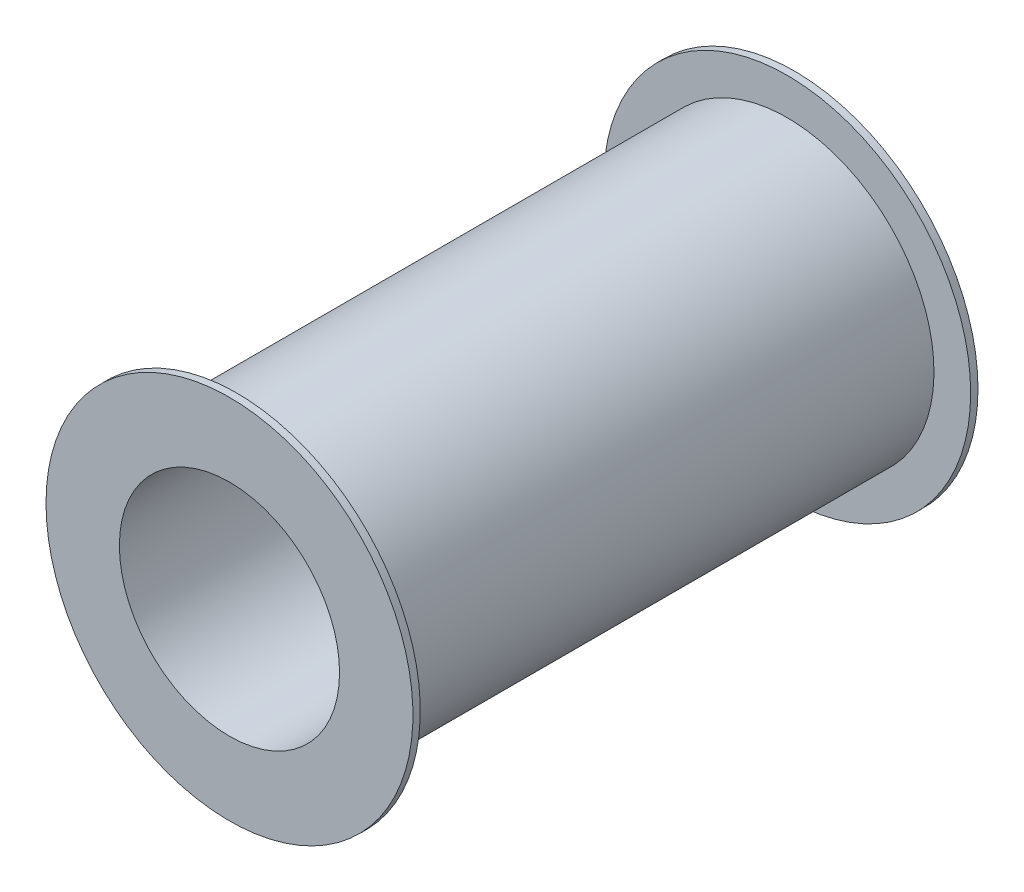
ISO-10303-21;
HEADER;
FILE_DESCRIPTION(('STEP AP214'),'2;1');
FILE_NAME('part.step','',(''),(''),'','','');
FILE_SCHEMA(('AUTOMOTIVE_DESIGN { 1 0 10303 214 1 1 1 1 }'));
ENDSEC;
DATA;
#1=APPLICATION_CONTEXT('core data for automotive mechanical design processes');
#2=APPLICATION_PROTOCOL_DEFINITION('international standard','automotive_design',2000,#1);
#3=PRODUCT_CONTEXT('',#1,'mechanical');
#4=PRODUCT('Part','Part','',(#3));
#5=PRODUCT_RELATED_PRODUCT_CATEGORY('part','',(#4));
#6=PRODUCT_DEFINITION_FORMATION('','',#4);
#7=PRODUCT_DEFINITION_CONTEXT('part definition',#1,'design');
#8=PRODUCT_DEFINITION('design','',#6,#7);
#9=PRODUCT_DEFINITION_SHAPE('','',#8);
#10=(LENGTH_UNIT() NAMED_UNIT(*) SI_UNIT(.MILLI.,.METRE.));
#11=(NAMED_UNIT(*) PLANE_ANGLE_UNIT() SI_UNIT($,.RADIAN.));
#12=(NAMED_UNIT(*) SI_UNIT($,.STERADIAN.) SOLID_ANGLE_UNIT());
#13=UNCERTAINTY_MEASURE_WITH_UNIT(LENGTH_MEASURE(1.E-05),#10,'distance_accuracy_value','');
#14=(GEOMETRIC_REPRESENTATION_CONTEXT(3) GLOBAL_UNCERTAINTY_ASSIGNED_CONTEXT((#13)) GLOBAL_UNIT_ASSIGNED_CONTEXT((#10,
#11,#12)) REPRESENTATION_CONTEXT('',''));
#15=CARTESIAN_POINT('',(0.,0.,0.));
#16=DIRECTION('',(0.,0.,1.));
#17=DIRECTION('',(1.,0.,0.));
#18=AXIS2_PLACEMENT_3D('',#15,#16,#17);
#19=CARTESIAN_POINT('',(6.12500000000001,-4.2,-7.02));
#20=DIRECTION('',(0.,0.,1.));
#21=DIRECTION('',(1.,0.,0.));
#22=AXIS2_PLACEMENT_3D('',#19,#20,#21);
#23=CYLINDRICAL_SURFACE('',#22,0.499999999999995);
#24=CARTESIAN_POINT('',(6.12500000000001,-4.2,-7.));
#25=DIRECTION('',(0.,0.,1.));
#26=DIRECTION('',(1.,0.,0.));
#27=AXIS2_PLACEMENT_3D('',#24,#25,#26);
#28=CIRCLE('',#27,0.499999999999995);
#29=CARTESIAN_POINT('',(6.625,-4.2,-7.));
#30=VERTEX_POINT('',#29);
#31=EDGE_CURVE('E41',#30,#30,#28,.T.);
#32=ORIENTED_EDGE('',*,*,#31,.F.);
#33=EDGE_LOOP('',(#32));
#34=FACE_BOUND('',#33,.T.);
#35=CARTESIAN_POINT('',(6.12500000000001,-4.2,-7.02));
#36=DIRECTION('',(0.,0.,1.));
#37=DIRECTION('',(1.,0.,0.));
#38=AXIS2_PLACEMENT_3D('',#35,#36,#37);
#39=CIRCLE('',#38,0.499999999999995);
#40=CARTESIAN_POINT('',(6.625,-4.2,-7.02));
#41=VERTEX_POINT('',#40);
#42=EDGE_CURVE('E19',#41,#41,#39,.F.);
#43=ORIENTED_EDGE('',*,*,#42,.F.);
#44=EDGE_LOOP('',(#43));
#45=FACE_BOUND('',#44,.T.);
#46=ADVANCED_FACE('F15',(#34,#45),#23,.T.);
#47=CARTESIAN_POINT('',(5.624,-3.699,-7.02));
#48=DIRECTION('',(0.,0.,-1.));
#49=DIRECTION('',(1.,0.,0.));
#50=AXIS2_PLACEMENT_3D('',#47,#48,#49);
#51=PLANE('',#50);
#52=CARTESIAN_POINT('',(6.12500000000001,-4.2,-7.02));
#53=DIRECTION('',(0.,0.,-1.));
#54=DIRECTION('',(-1.,0.,0.));
#55=AXIS2_PLACEMENT_3D('',#52,#53,#54);
#56=CIRCLE('',#55,0.299999999999996);
#57=CARTESIAN_POINT('',(5.82500000000001,-4.2,-7.02));
#58=VERTEX_POINT('',#57);
#59=EDGE_CURVE('E39',#58,#58,#56,.T.);
#60=ORIENTED_EDGE('',*,*,#59,.F.);
#61=EDGE_LOOP('',(#60));
#62=FACE_BOUND('',#61,.T.);
#63=ORIENTED_EDGE('',*,*,#42,.T.);
#64=EDGE_LOOP('',(#63));
#65=FACE_BOUND('',#64,.T.);
#66=ADVANCED_FACE('F48',(#62,#65),#51,.T.);
#67=CARTESIAN_POINT('',(6.626,-3.699,-7.));
#68=DIRECTION('',(0.,0.,1.));
#69=DIRECTION('',(-1.,0.,0.));
#70=AXIS2_PLACEMENT_3D('',#67,#68,#69);
#71=PLANE('',#70);
#72=CARTESIAN_POINT('',(6.125,-4.2,-7.));
#73=DIRECTION('',(0.,0.,1.));
#74=DIRECTION('',(0.,-1.,0.));
#75=AXIS2_PLACEMENT_3D('',#72,#73,#74);
#76=CIRCLE('',#75,0.399999999999999);
#77=CARTESIAN_POINT('',(6.125,-4.6,-7.));
#78=VERTEX_POINT('',#77);
#79=EDGE_CURVE('E36',#78,#78,#76,.T.);
#80=ORIENTED_EDGE('',*,*,#79,.F.);
#81=EDGE_LOOP('',(#80));
#82=FACE_BOUND('',#81,.T.);
#83=ORIENTED_EDGE('',*,*,#31,.T.);
#84=EDGE_LOOP('',(#83));
#85=FACE_BOUND('',#84,.T.);
#86=ADVANCED_FACE('F57',(#82,#85),#71,.T.);
#87=CARTESIAN_POINT('',(6.12500000000001,-4.2,-5.48));
#88=DIRECTION('',(0.,0.,-1.));
#89=DIRECTION('',(-1.,0.,0.));
#90=AXIS2_PLACEMENT_3D('',#87,#88,#89);
#91=CYLINDRICAL_SURFACE('',#90,0.299999999999996);
#92=ORIENTED_EDGE('',*,*,#59,.T.);
#93=EDGE_LOOP('',(#92));
#94=FACE_BOUND('',#93,.T.);
#95=CARTESIAN_POINT('',(6.12500000000001,-4.2,-5.48));
#96=DIRECTION('',(0.,0.,-1.));
#97=DIRECTION('',(-1.,0.,0.));
#98=AXIS2_PLACEMENT_3D('',#95,#96,#97);
#99=CIRCLE('',#98,0.299999999999996);
#100=CARTESIAN_POINT('',(5.82500000000001,-4.2,-5.48));
#101=VERTEX_POINT('',#100);
#102=EDGE_CURVE('E33',#101,#101,#99,.T.);
#103=ORIENTED_EDGE('',*,*,#102,.F.);
#104=EDGE_LOOP('',(#103));
#105=FACE_BOUND('',#104,.T.);
#106=ADVANCED_FACE('F77',(#94,#105),#91,.F.);
#107=CARTESIAN_POINT('',(6.125,-4.2,-7.));
#108=DIRECTION('',(0.,0.,1.));
#109=DIRECTION('',(0.,-1.,0.));
#110=AXIS2_PLACEMENT_3D('',#107,#108,#109);
#111=CYLINDRICAL_SURFACE('',#110,0.399999999999999);
#112=CARTESIAN_POINT('',(6.125,-4.2,-5.5));
#113=DIRECTION('',(0.,0.,1.));
#114=DIRECTION('',(0.,-1.,0.));
#115=AXIS2_PLACEMENT_3D('',#112,#113,#114);
#116=CIRCLE('',#115,0.399999999999999);
#117=CARTESIAN_POINT('',(6.125,-4.6,-5.5));
#118=VERTEX_POINT('',#117);
#119=EDGE_CURVE('E28',#118,#118,#116,.T.);
#120=ORIENTED_EDGE('',*,*,#119,.F.);
#121=EDGE_LOOP('',(#120));
#122=FACE_BOUND('',#121,.T.);
#123=ORIENTED_EDGE('',*,*,#79,.T.);
#124=EDGE_LOOP('',(#123));
#125=FACE_BOUND('',#124,.T.);
#126=ADVANCED_FACE('F71',(#122,#125),#111,.T.);
#127=CARTESIAN_POINT('',(5.624,-4.701,-5.48));
#128=DIRECTION('',(0.,0.,1.));
#129=DIRECTION('',(1.,0.,0.));
#130=AXIS2_PLACEMENT_3D('',#127,#128,#129);
#131=PLANE('',#130);
#132=ORIENTED_EDGE('',*,*,#102,.T.);
#133=EDGE_LOOP('',(#132));
#134=FACE_BOUND('',#133,.T.);
#135=CARTESIAN_POINT('',(6.125,-4.2,-5.48));
#136=DIRECTION('',(0.,0.,-1.));
#137=DIRECTION('',(-1.,0.,0.));
#138=AXIS2_PLACEMENT_3D('',#135,#136,#137);
#139=CIRCLE('',#138,0.5);
#140=CARTESIAN_POINT('',(5.625,-4.2,-5.48));
#141=VERTEX_POINT('',#140);
#142=EDGE_CURVE('E23',#141,#141,#139,.T.);
#143=ORIENTED_EDGE('',*,*,#142,.F.);
#144=EDGE_LOOP('',(#143));
#145=FACE_BOUND('',#144,.T.);
#146=ADVANCED_FACE('F65',(#134,#145),#131,.T.);
#147=CARTESIAN_POINT('',(6.626,-4.701,-5.5));
#148=DIRECTION('',(0.,0.,-1.));
#149=DIRECTION('',(-1.,0.,0.));
#150=AXIS2_PLACEMENT_3D('',#147,#148,#149);
#151=PLANE('',#150);
#152=ORIENTED_EDGE('',*,*,#119,.T.);
#153=EDGE_LOOP('',(#152));
#154=FACE_BOUND('',#153,.T.);
#155=CARTESIAN_POINT('',(6.125,-4.2,-5.5));
#156=DIRECTION('',(0.,0.,-1.));
#157=DIRECTION('',(-1.,0.,0.));
#158=AXIS2_PLACEMENT_3D('',#155,#156,#157);
#159=CIRCLE('',#158,0.5);
#160=CARTESIAN_POINT('',(5.625,-4.2,-5.5));
#161=VERTEX_POINT('',#160);
#162=EDGE_CURVE('E10',#161,#161,#159,.F.);
#163=ORIENTED_EDGE('',*,*,#162,.F.);
#164=EDGE_LOOP('',(#163));
#165=FACE_BOUND('',#164,.T.);
#166=ADVANCED_FACE('F61',(#154,#165),#151,.T.);
#167=CARTESIAN_POINT('',(6.125,-4.2,-5.48));
#168=DIRECTION('',(0.,0.,-1.));
#169=DIRECTION('',(-1.,0.,0.));
#170=AXIS2_PLACEMENT_3D('',#167,#168,#169);
#171=CYLINDRICAL_SURFACE('',#170,0.5);
#172=ORIENTED_EDGE('',*,*,#162,.T.);
#173=EDGE_LOOP('',(#172));
#174=FACE_BOUND('',#173,.T.);
#175=ORIENTED_EDGE('',*,*,#142,.T.);
#176=EDGE_LOOP('',(#175));
#177=FACE_BOUND('',#176,.T.);
#178=ADVANCED_FACE('F17',(#174,#177),#171,.T.);
#179=CLOSED_SHELL('',(#46,#66,#86,#106,#126,#146,#166,#178));
#180=MANIFOLD_SOLID_BREP('B1',#179);
#181=ADVANCED_BREP_SHAPE_REPRESENTATION('',(#18,#180),#14);
#182=SHAPE_DEFINITION_REPRESENTATION(#9,#181);
ENDSEC;
END-ISO-10303-21;
